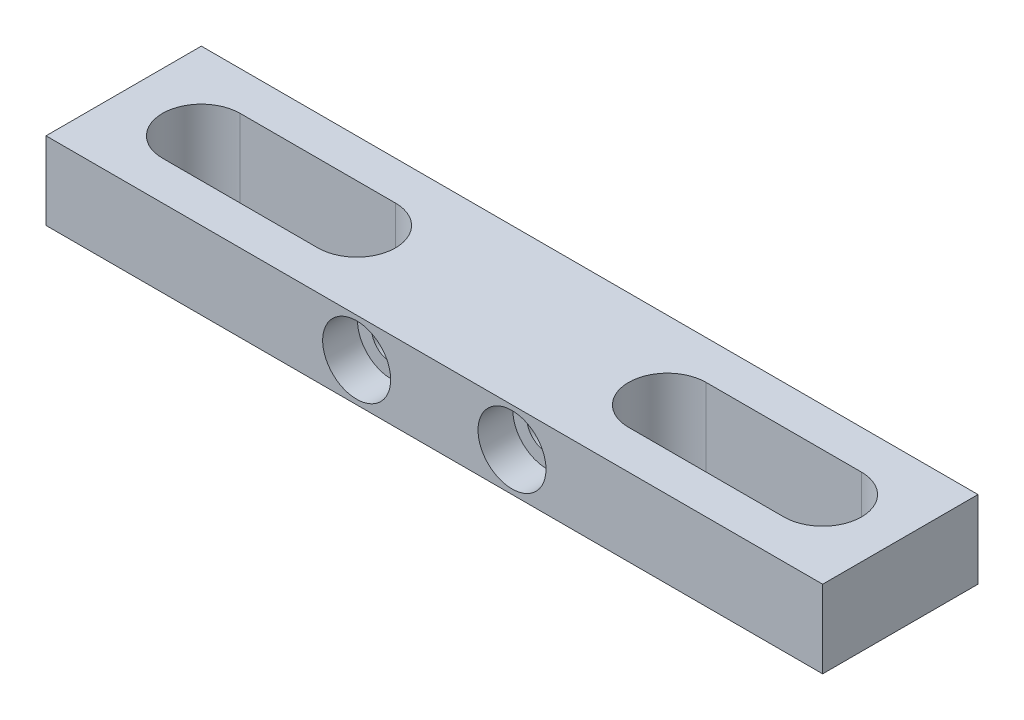
ISO-10303-21;
HEADER;
FILE_DESCRIPTION(('STEP AP214'),'2;1');
FILE_NAME('part.step','',(''),(''),'','','');
FILE_SCHEMA(('AUTOMOTIVE_DESIGN { 1 0 10303 214 1 1 1 1 }'));
ENDSEC;
DATA;
#1=APPLICATION_CONTEXT('core data for automotive mechanical design processes');
#2=APPLICATION_PROTOCOL_DEFINITION('international standard','automotive_design',2000,#1);
#3=PRODUCT_CONTEXT('',#1,'mechanical');
#4=PRODUCT('Part','Part','',(#3));
#5=PRODUCT_RELATED_PRODUCT_CATEGORY('part','',(#4));
#6=PRODUCT_DEFINITION_FORMATION('','',#4);
#7=PRODUCT_DEFINITION_CONTEXT('part definition',#1,'design');
#8=PRODUCT_DEFINITION('design','',#6,#7);
#9=PRODUCT_DEFINITION_SHAPE('','',#8);
#10=(LENGTH_UNIT() NAMED_UNIT(*) SI_UNIT(.MILLI.,.METRE.));
#11=(NAMED_UNIT(*) PLANE_ANGLE_UNIT() SI_UNIT($,.RADIAN.));
#12=(NAMED_UNIT(*) SI_UNIT($,.STERADIAN.) SOLID_ANGLE_UNIT());
#13=UNCERTAINTY_MEASURE_WITH_UNIT(LENGTH_MEASURE(1.E-05),#10,'distance_accuracy_value','');
#14=(GEOMETRIC_REPRESENTATION_CONTEXT(3) GLOBAL_UNCERTAINTY_ASSIGNED_CONTEXT((#13)) GLOBAL_UNIT_ASSIGNED_CONTEXT((#10,
#11,#12)) REPRESENTATION_CONTEXT('',''));
#15=CARTESIAN_POINT('',(0.,0.,0.));
#16=DIRECTION('',(0.,0.,1.));
#17=DIRECTION('',(1.,0.,0.));
#18=AXIS2_PLACEMENT_3D('',#15,#16,#17);
#19=CARTESIAN_POINT('',(-10.8557755775578,6.35,-8.84179867986799));
#20=DIRECTION('',(1.,0.,0.));
#21=DIRECTION('',(0.,0.,-1.));
#22=AXIS2_PLACEMENT_3D('',#19,#20,#21);
#23=PLANE('',#22);
#24=DIRECTION('',(0.,0.,1.));
#25=VECTOR('',#24,1.);
#26=CARTESIAN_POINT('',(-10.8557755775578,0.,-8.84179867986799));
#27=LINE('',#26,#25);
#28=CARTESIAN_POINT('',(-10.8557755775578,0.,-8.84179867986799));
#29=VERTEX_POINT('',#28);
#30=CARTESIAN_POINT('',(-10.8557755775578,0.,3.85820132013201));
#31=VERTEX_POINT('',#30);
#32=EDGE_CURVE('E267',#29,#31,#27,.T.);
#33=ORIENTED_EDGE('',*,*,#32,.T.);
#34=DIRECTION('',(0.,-1.,0.));
#35=VECTOR('',#34,1.);
#36=CARTESIAN_POINT('',(-10.8557755775578,6.35,3.85820132013201));
#37=LINE('',#36,#35);
#38=CARTESIAN_POINT('',(-10.8557755775578,6.35,3.85820132013201));
#39=VERTEX_POINT('',#38);
#40=EDGE_CURVE('E14',#39,#31,#37,.T.);
#41=ORIENTED_EDGE('',*,*,#40,.F.);
#42=DIRECTION('',(0.,0.,1.));
#43=VECTOR('',#42,1.);
#44=CARTESIAN_POINT('',(-10.8557755775578,6.35,-8.84179867986799));
#45=LINE('',#44,#43);
#46=CARTESIAN_POINT('',(-10.8557755775578,6.35,-8.84179867986799));
#47=VERTEX_POINT('',#46);
#48=EDGE_CURVE('E268',#47,#39,#45,.T.);
#49=ORIENTED_EDGE('',*,*,#48,.F.);
#50=DIRECTION('',(0.,-1.,0.));
#51=VECTOR('',#50,1.);
#52=CARTESIAN_POINT('',(-10.8557755775578,6.35,-8.84179867986799));
#53=LINE('',#52,#51);
#54=EDGE_CURVE('E278',#47,#29,#53,.T.);
#55=ORIENTED_EDGE('',*,*,#54,.T.);
#56=EDGE_LOOP('',(#33,#41,#49,#55));
#57=FACE_BOUND('',#56,.T.);
#58=ADVANCED_FACE('F87',(#57),#23,.F.);
#59=CARTESIAN_POINT('',(-10.8557755775578,6.35,3.85820132013201));
#60=DIRECTION('',(0.,0.,-1.));
#61=DIRECTION('',(-1.,0.,0.));
#62=AXIS2_PLACEMENT_3D('',#59,#60,#61);
#63=PLANE('',#62);
#64=CARTESIAN_POINT('',(14.5442244224422,3.175,3.85820132013201));
#65=DIRECTION('',(0.,0.,1.));
#66=DIRECTION('',(1.,0.,0.));
#67=AXIS2_PLACEMENT_3D('',#64,#65,#66);
#68=CIRCLE('',#67,2.77876);
#69=CARTESIAN_POINT('',(17.3229844224422,3.175,3.85820132013201));
#70=VERTEX_POINT('',#69);
#71=EDGE_CURVE('E237',#70,#70,#68,.T.);
#72=ORIENTED_EDGE('',*,*,#71,.F.);
#73=EDGE_LOOP('',(#72));
#74=FACE_BOUND('',#73,.T.);
#75=CARTESIAN_POINT('',(27.2442244224422,3.175,3.85820132013201));
#76=DIRECTION('',(0.,0.,1.));
#77=DIRECTION('',(1.,0.,0.));
#78=AXIS2_PLACEMENT_3D('',#75,#76,#77);
#79=CIRCLE('',#78,2.77876);
#80=CARTESIAN_POINT('',(30.0229844224422,3.175,3.85820132013201));
#81=VERTEX_POINT('',#80);
#82=EDGE_CURVE('E255',#81,#81,#79,.T.);
#83=ORIENTED_EDGE('',*,*,#82,.F.);
#84=EDGE_LOOP('',(#83));
#85=FACE_BOUND('',#84,.T.);
#86=DIRECTION('',(1.,0.,0.));
#87=VECTOR('',#86,1.);
#88=CARTESIAN_POINT('',(-10.8557755775578,0.,3.85820132013201));
#89=LINE('',#88,#87);
#90=CARTESIAN_POINT('',(52.6442244224422,0.,3.85820132013201));
#91=VERTEX_POINT('',#90);
#92=EDGE_CURVE('E281',#31,#91,#89,.T.);
#93=ORIENTED_EDGE('',*,*,#92,.T.);
#94=DIRECTION('',(0.,-1.,0.));
#95=VECTOR('',#94,1.);
#96=CARTESIAN_POINT('',(52.6442244224422,6.35,3.85820132013201));
#97=LINE('',#96,#95);
#98=CARTESIAN_POINT('',(52.6442244224422,6.35,3.85820132013201));
#99=VERTEX_POINT('',#98);
#100=EDGE_CURVE('E94',#99,#91,#97,.T.);
#101=ORIENTED_EDGE('',*,*,#100,.F.);
#102=DIRECTION('',(1.,0.,0.));
#103=VECTOR('',#102,1.);
#104=CARTESIAN_POINT('',(-10.8557755775578,6.35,3.85820132013201));
#105=LINE('',#104,#103);
#106=EDGE_CURVE('E271',#39,#99,#105,.T.);
#107=ORIENTED_EDGE('',*,*,#106,.F.);
#108=ORIENTED_EDGE('',*,*,#40,.T.);
#109=EDGE_LOOP('',(#93,#101,#107,#108));
#110=FACE_BOUND('',#109,.T.);
#111=ADVANCED_FACE('F310',(#74,#85,#110),#63,.F.);
#112=CARTESIAN_POINT('',(52.6442244224422,6.35,-8.84179867986799));
#113=DIRECTION('',(-1.,0.,0.));
#114=DIRECTION('',(0.,0.,1.));
#115=AXIS2_PLACEMENT_3D('',#112,#113,#114);
#116=PLANE('',#115);
#117=DIRECTION('',(0.,0.,-1.));
#118=VECTOR('',#117,1.);
#119=CARTESIAN_POINT('',(52.6442244224422,0.,-8.84179867986799));
#120=LINE('',#119,#118);
#121=CARTESIAN_POINT('',(52.6442244224422,0.,-8.84179867986799));
#122=VERTEX_POINT('',#121);
#123=EDGE_CURVE('E283',#91,#122,#120,.T.);
#124=ORIENTED_EDGE('',*,*,#123,.T.);
#125=DIRECTION('',(0.,-1.,0.));
#126=VECTOR('',#125,1.);
#127=CARTESIAN_POINT('',(52.6442244224422,6.35,-8.84179867986799));
#128=LINE('',#127,#126);
#129=CARTESIAN_POINT('',(52.6442244224422,6.35,-8.84179867986799));
#130=VERTEX_POINT('',#129);
#131=EDGE_CURVE('E288',#130,#122,#128,.T.);
#132=ORIENTED_EDGE('',*,*,#131,.F.);
#133=DIRECTION('',(0.,0.,-1.));
#134=VECTOR('',#133,1.);
#135=CARTESIAN_POINT('',(52.6442244224422,6.35,-8.84179867986799));
#136=LINE('',#135,#134);
#137=EDGE_CURVE('E274',#99,#130,#136,.T.);
#138=ORIENTED_EDGE('',*,*,#137,.F.);
#139=ORIENTED_EDGE('',*,*,#100,.T.);
#140=EDGE_LOOP('',(#124,#132,#138,#139));
#141=FACE_BOUND('',#140,.T.);
#142=ADVANCED_FACE('F295',(#141),#116,.F.);
#143=CARTESIAN_POINT('',(-10.8557755775578,6.35,-8.84179867986799));
#144=DIRECTION('',(0.,0.,1.));
#145=DIRECTION('',(1.,0.,0.));
#146=AXIS2_PLACEMENT_3D('',#143,#144,#145);
#147=PLANE('',#146);
#148=CARTESIAN_POINT('',(14.5442244224422,3.175,-8.84179867986799));
#149=DIRECTION('',(0.,0.,1.));
#150=DIRECTION('',(1.,0.,0.));
#151=AXIS2_PLACEMENT_3D('',#148,#149,#150);
#152=CIRCLE('',#151,1.63195);
#153=CARTESIAN_POINT('',(16.1761744224422,3.175,-8.84179867986799));
#154=VERTEX_POINT('',#153);
#155=EDGE_CURVE('E252',#154,#154,#152,.T.);
#156=ORIENTED_EDGE('',*,*,#155,.T.);
#157=EDGE_LOOP('',(#156));
#158=FACE_BOUND('',#157,.T.);
#159=CARTESIAN_POINT('',(27.2442244224422,3.175,-8.84179867986799));
#160=DIRECTION('',(0.,0.,1.));
#161=DIRECTION('',(1.,0.,0.));
#162=AXIS2_PLACEMENT_3D('',#159,#160,#161);
#163=CIRCLE('',#162,1.63195);
#164=CARTESIAN_POINT('',(28.8761744224422,3.175,-8.84179867986799));
#165=VERTEX_POINT('',#164);
#166=EDGE_CURVE('E264',#165,#165,#163,.T.);
#167=ORIENTED_EDGE('',*,*,#166,.T.);
#168=EDGE_LOOP('',(#167));
#169=FACE_BOUND('',#168,.T.);
#170=DIRECTION('',(-1.,0.,0.));
#171=VECTOR('',#170,1.);
#172=CARTESIAN_POINT('',(-10.8557755775578,0.,-8.84179867986799));
#173=LINE('',#172,#171);
#174=EDGE_CURVE('E272',#122,#29,#173,.T.);
#175=ORIENTED_EDGE('',*,*,#174,.T.);
#176=ORIENTED_EDGE('',*,*,#54,.F.);
#177=DIRECTION('',(-1.,0.,0.));
#178=VECTOR('',#177,1.);
#179=CARTESIAN_POINT('',(-10.8557755775578,6.35,-8.84179867986799));
#180=LINE('',#179,#178);
#181=EDGE_CURVE('E276',#130,#47,#180,.T.);
#182=ORIENTED_EDGE('',*,*,#181,.F.);
#183=ORIENTED_EDGE('',*,*,#131,.T.);
#184=EDGE_LOOP('',(#175,#176,#182,#183));
#185=FACE_BOUND('',#184,.T.);
#186=ADVANCED_FACE('F303',(#158,#169,#185),#147,.F.);
#187=CARTESIAN_POINT('',(0.,6.35,0.));
#188=DIRECTION('',(0.,1.,0.));
#189=DIRECTION('',(0.,0.,1.));
#190=AXIS2_PLACEMENT_3D('',#187,#188,#189);
#191=PLANE('',#190);
#192=CARTESIAN_POINT('',(33.5942244224423,6.35,-2.49179867986799));
#193=DIRECTION('',(0.,1.,0.));
#194=DIRECTION('',(0.,0.,1.));
#195=AXIS2_PLACEMENT_3D('',#192,#193,#194);
#196=CIRCLE('',#195,3.175);
#197=CARTESIAN_POINT('',(33.5942244224423,6.35,-5.66679867986799));
#198=VERTEX_POINT('',#197);
#199=CARTESIAN_POINT('',(33.5942244224423,6.35,0.683201320132012));
#200=VERTEX_POINT('',#199);
#201=EDGE_CURVE('E101',#198,#200,#196,.T.);
#202=ORIENTED_EDGE('',*,*,#201,.F.);
#203=DIRECTION('',(-1.,0.,0.));
#204=VECTOR('',#203,1.);
#205=CARTESIAN_POINT('',(33.5942244224423,6.35,-5.66679867986799));
#206=LINE('',#205,#204);
#207=CARTESIAN_POINT('',(46.2942244224422,6.35,-5.66679867986799));
#208=VERTEX_POINT('',#207);
#209=EDGE_CURVE('E193',#208,#198,#206,.T.);
#210=ORIENTED_EDGE('',*,*,#209,.F.);
#211=CARTESIAN_POINT('',(46.2942244224422,6.35,-2.49179867986799));
#212=DIRECTION('',(0.,1.,0.));
#213=DIRECTION('',(0.,0.,1.));
#214=AXIS2_PLACEMENT_3D('',#211,#212,#213);
#215=CIRCLE('',#214,3.175);
#216=CARTESIAN_POINT('',(46.2942244224422,6.35,0.683201320132012));
#217=VERTEX_POINT('',#216);
#218=EDGE_CURVE('E196',#217,#208,#215,.T.);
#219=ORIENTED_EDGE('',*,*,#218,.F.);
#220=DIRECTION('',(1.,0.,0.));
#221=VECTOR('',#220,1.);
#222=CARTESIAN_POINT('',(33.5942244224423,6.35,0.683201320132012));
#223=LINE('',#222,#221);
#224=EDGE_CURVE('E202',#200,#217,#223,.T.);
#225=ORIENTED_EDGE('',*,*,#224,.F.);
#226=EDGE_LOOP('',(#202,#210,#219,#225));
#227=FACE_BOUND('',#226,.T.);
#228=CARTESIAN_POINT('',(-4.50577557755775,6.35,-2.49179867986799));
#229=DIRECTION('',(0.,1.,0.));
#230=DIRECTION('',(0.,0.,1.));
#231=AXIS2_PLACEMENT_3D('',#228,#229,#230);
#232=CIRCLE('',#231,3.175);
#233=CARTESIAN_POINT('',(-4.50577557755775,6.35,-5.66679867986799));
#234=VERTEX_POINT('',#233);
#235=CARTESIAN_POINT('',(-4.50577557755775,6.35,0.683201320132011));
#236=VERTEX_POINT('',#235);
#237=EDGE_CURVE('E208',#234,#236,#232,.T.);
#238=ORIENTED_EDGE('',*,*,#237,.F.);
#239=DIRECTION('',(-1.,0.,0.));
#240=VECTOR('',#239,1.);
#241=CARTESIAN_POINT('',(-4.50577557755775,6.35,-5.66679867986799));
#242=LINE('',#241,#240);
#243=CARTESIAN_POINT('',(8.19422442244225,6.35,-5.66679867986799));
#244=VERTEX_POINT('',#243);
#245=EDGE_CURVE('E216',#244,#234,#242,.T.);
#246=ORIENTED_EDGE('',*,*,#245,.F.);
#247=CARTESIAN_POINT('',(8.19422442244225,6.35,-2.49179867986799));
#248=DIRECTION('',(0.,1.,0.));
#249=DIRECTION('',(0.,0.,1.));
#250=AXIS2_PLACEMENT_3D('',#247,#248,#249);
#251=CIRCLE('',#250,3.175);
#252=CARTESIAN_POINT('',(8.19422442244225,6.35,0.683201320132011));
#253=VERTEX_POINT('',#252);
#254=EDGE_CURVE('E230',#253,#244,#251,.T.);
#255=ORIENTED_EDGE('',*,*,#254,.F.);
#256=DIRECTION('',(1.,0.,0.));
#257=VECTOR('',#256,1.);
#258=CARTESIAN_POINT('',(-4.50577557755775,6.35,0.683201320132011));
#259=LINE('',#258,#257);
#260=EDGE_CURVE('E227',#236,#253,#259,.T.);
#261=ORIENTED_EDGE('',*,*,#260,.F.);
#262=EDGE_LOOP('',(#238,#246,#255,#261));
#263=FACE_BOUND('',#262,.T.);
#264=ORIENTED_EDGE('',*,*,#48,.T.);
#265=ORIENTED_EDGE('',*,*,#106,.T.);
#266=ORIENTED_EDGE('',*,*,#137,.T.);
#267=ORIENTED_EDGE('',*,*,#181,.T.);
#268=EDGE_LOOP('',(#264,#265,#266,#267));
#269=FACE_BOUND('',#268,.T.);
#270=ADVANCED_FACE('F309',(#227,#263,#269),#191,.T.);
#271=CARTESIAN_POINT('',(0.,0.,0.));
#272=DIRECTION('',(0.,1.,0.));
#273=DIRECTION('',(0.,0.,1.));
#274=AXIS2_PLACEMENT_3D('',#271,#272,#273);
#275=PLANE('',#274);
#276=DIRECTION('',(-1.,0.,0.));
#277=VECTOR('',#276,1.);
#278=CARTESIAN_POINT('',(33.5942244224423,0.,-5.66679867986799));
#279=LINE('',#278,#277);
#280=CARTESIAN_POINT('',(46.2942244224422,0.,-5.66679867986799));
#281=VERTEX_POINT('',#280);
#282=CARTESIAN_POINT('',(33.5942244224423,0.,-5.66679867986799));
#283=VERTEX_POINT('',#282);
#284=EDGE_CURVE('E183',#281,#283,#279,.T.);
#285=ORIENTED_EDGE('',*,*,#284,.T.);
#286=CARTESIAN_POINT('',(33.5942244224423,0.,-2.49179867986799));
#287=DIRECTION('',(0.,1.,0.));
#288=DIRECTION('',(0.,0.,1.));
#289=AXIS2_PLACEMENT_3D('',#286,#287,#288);
#290=CIRCLE('',#289,3.175);
#291=CARTESIAN_POINT('',(33.5942244224423,0.,0.683201320132012));
#292=VERTEX_POINT('',#291);
#293=EDGE_CURVE('E177',#283,#292,#290,.T.);
#294=ORIENTED_EDGE('',*,*,#293,.T.);
#295=DIRECTION('',(1.,0.,0.));
#296=VECTOR('',#295,1.);
#297=CARTESIAN_POINT('',(33.5942244224423,0.,0.683201320132012));
#298=LINE('',#297,#296);
#299=CARTESIAN_POINT('',(46.2942244224422,0.,0.683201320132012));
#300=VERTEX_POINT('',#299);
#301=EDGE_CURVE('E186',#292,#300,#298,.T.);
#302=ORIENTED_EDGE('',*,*,#301,.T.);
#303=CARTESIAN_POINT('',(46.2942244224422,0.,-2.49179867986799));
#304=DIRECTION('',(0.,1.,0.));
#305=DIRECTION('',(0.,0.,1.));
#306=AXIS2_PLACEMENT_3D('',#303,#304,#305);
#307=CIRCLE('',#306,3.175);
#308=EDGE_CURVE('E109',#300,#281,#307,.T.);
#309=ORIENTED_EDGE('',*,*,#308,.T.);
#310=EDGE_LOOP('',(#285,#294,#302,#309));
#311=FACE_BOUND('',#310,.T.);
#312=DIRECTION('',(-1.,0.,0.));
#313=VECTOR('',#312,1.);
#314=CARTESIAN_POINT('',(-4.50577557755775,0.,-5.66679867986799));
#315=LINE('',#314,#313);
#316=CARTESIAN_POINT('',(8.19422442244225,0.,-5.66679867986799));
#317=VERTEX_POINT('',#316);
#318=CARTESIAN_POINT('',(-4.50577557755775,0.,-5.66679867986799));
#319=VERTEX_POINT('',#318);
#320=EDGE_CURVE('E222',#317,#319,#315,.T.);
#321=ORIENTED_EDGE('',*,*,#320,.T.);
#322=CARTESIAN_POINT('',(-4.50577557755775,0.,-2.49179867986799));
#323=DIRECTION('',(0.,1.,0.));
#324=DIRECTION('',(0.,0.,1.));
#325=AXIS2_PLACEMENT_3D('',#322,#323,#324);
#326=CIRCLE('',#325,3.175);
#327=CARTESIAN_POINT('',(-4.50577557755775,0.,0.683201320132011));
#328=VERTEX_POINT('',#327);
#329=EDGE_CURVE('E212',#319,#328,#326,.T.);
#330=ORIENTED_EDGE('',*,*,#329,.T.);
#331=DIRECTION('',(1.,0.,0.));
#332=VECTOR('',#331,1.);
#333=CARTESIAN_POINT('',(-4.50577557755775,0.,0.683201320132011));
#334=LINE('',#333,#332);
#335=CARTESIAN_POINT('',(8.19422442244225,0.,0.683201320132011));
#336=VERTEX_POINT('',#335);
#337=EDGE_CURVE('E215',#328,#336,#334,.T.);
#338=ORIENTED_EDGE('',*,*,#337,.T.);
#339=CARTESIAN_POINT('',(8.19422442244225,0.,-2.49179867986799));
#340=DIRECTION('',(0.,1.,0.));
#341=DIRECTION('',(0.,0.,1.));
#342=AXIS2_PLACEMENT_3D('',#339,#340,#341);
#343=CIRCLE('',#342,3.175);
#344=EDGE_CURVE('E219',#336,#317,#343,.T.);
#345=ORIENTED_EDGE('',*,*,#344,.T.);
#346=EDGE_LOOP('',(#321,#330,#338,#345));
#347=FACE_BOUND('',#346,.T.);
#348=ORIENTED_EDGE('',*,*,#32,.F.);
#349=ORIENTED_EDGE('',*,*,#174,.F.);
#350=ORIENTED_EDGE('',*,*,#123,.F.);
#351=ORIENTED_EDGE('',*,*,#92,.F.);
#352=EDGE_LOOP('',(#348,#349,#350,#351));
#353=FACE_BOUND('',#352,.T.);
#354=ADVANCED_FACE('F190',(#311,#347,#353),#275,.F.);
#355=CARTESIAN_POINT('',(27.2442244224422,3.175,3.85820132013201));
#356=DIRECTION('',(0.,0.,1.));
#357=DIRECTION('',(1.,0.,0.));
#358=AXIS2_PLACEMENT_3D('',#355,#356,#357);
#359=CYLINDRICAL_SURFACE('',#358,1.63195);
#360=ORIENTED_EDGE('',*,*,#166,.F.);
#361=EDGE_LOOP('',(#360));
#362=FACE_BOUND('',#361,.T.);
#363=CARTESIAN_POINT('',(27.2442244224422,3.175,1.01340132013201));
#364=DIRECTION('',(0.,0.,1.));
#365=DIRECTION('',(1.,0.,0.));
#366=AXIS2_PLACEMENT_3D('',#363,#364,#365);
#367=CIRCLE('',#366,1.63195);
#368=CARTESIAN_POINT('',(28.8761744224422,3.175,1.01340132013201));
#369=VERTEX_POINT('',#368);
#370=EDGE_CURVE('E261',#369,#369,#367,.T.);
#371=ORIENTED_EDGE('',*,*,#370,.T.);
#372=EDGE_LOOP('',(#371));
#373=FACE_BOUND('',#372,.T.);
#374=ADVANCED_FACE('F326',(#362,#373),#359,.F.);
#375=CARTESIAN_POINT('',(28.8761744224422,3.175,1.01340132013201));
#376=DIRECTION('',(0.,0.,-1.));
#377=DIRECTION('',(-1.,0.,0.));
#378=AXIS2_PLACEMENT_3D('',#375,#376,#377);
#379=PLANE('',#378);
#380=ORIENTED_EDGE('',*,*,#370,.F.);
#381=EDGE_LOOP('',(#380));
#382=FACE_BOUND('',#381,.T.);
#383=CARTESIAN_POINT('',(27.2442244224422,3.175,1.01340132013201));
#384=DIRECTION('',(0.,0.,1.));
#385=DIRECTION('',(1.,0.,0.));
#386=AXIS2_PLACEMENT_3D('',#383,#384,#385);
#387=CIRCLE('',#386,2.77876);
#388=CARTESIAN_POINT('',(30.0229844224422,3.175,1.01340132013201));
#389=VERTEX_POINT('',#388);
#390=EDGE_CURVE('E258',#389,#389,#387,.T.);
#391=ORIENTED_EDGE('',*,*,#390,.T.);
#392=EDGE_LOOP('',(#391));
#393=FACE_BOUND('',#392,.T.);
#394=ADVANCED_FACE('F332',(#382,#393),#379,.F.);
#395=CARTESIAN_POINT('',(27.2442244224422,3.175,3.85820132013201));
#396=DIRECTION('',(0.,0.,1.));
#397=DIRECTION('',(1.,0.,0.));
#398=AXIS2_PLACEMENT_3D('',#395,#396,#397);
#399=CYLINDRICAL_SURFACE('',#398,2.77876);
#400=ORIENTED_EDGE('',*,*,#390,.F.);
#401=EDGE_LOOP('',(#400));
#402=FACE_BOUND('',#401,.T.);
#403=ORIENTED_EDGE('',*,*,#82,.T.);
#404=EDGE_LOOP('',(#403));
#405=FACE_BOUND('',#404,.T.);
#406=ADVANCED_FACE('F336',(#402,#405),#399,.F.);
#407=CARTESIAN_POINT('',(14.5442244224422,3.175,3.85820132013201));
#408=DIRECTION('',(0.,0.,1.));
#409=DIRECTION('',(1.,0.,0.));
#410=AXIS2_PLACEMENT_3D('',#407,#408,#409);
#411=CYLINDRICAL_SURFACE('',#410,1.63195);
#412=ORIENTED_EDGE('',*,*,#155,.F.);
#413=EDGE_LOOP('',(#412));
#414=FACE_BOUND('',#413,.T.);
#415=CARTESIAN_POINT('',(14.5442244224422,3.175,1.01340132013201));
#416=DIRECTION('',(0.,0.,1.));
#417=DIRECTION('',(1.,0.,0.));
#418=AXIS2_PLACEMENT_3D('',#415,#416,#417);
#419=CIRCLE('',#418,1.63195);
#420=CARTESIAN_POINT('',(16.1761744224422,3.175,1.01340132013201));
#421=VERTEX_POINT('',#420);
#422=EDGE_CURVE('E249',#421,#421,#419,.T.);
#423=ORIENTED_EDGE('',*,*,#422,.T.);
#424=EDGE_LOOP('',(#423));
#425=FACE_BOUND('',#424,.T.);
#426=ADVANCED_FACE('F340',(#414,#425),#411,.F.);
#427=CARTESIAN_POINT('',(16.1761744224422,3.175,1.01340132013201));
#428=DIRECTION('',(0.,0.,-1.));
#429=DIRECTION('',(-1.,0.,0.));
#430=AXIS2_PLACEMENT_3D('',#427,#428,#429);
#431=PLANE('',#430);
#432=ORIENTED_EDGE('',*,*,#422,.F.);
#433=EDGE_LOOP('',(#432));
#434=FACE_BOUND('',#433,.T.);
#435=CARTESIAN_POINT('',(14.5442244224422,3.175,1.01340132013201));
#436=DIRECTION('',(0.,0.,1.));
#437=DIRECTION('',(1.,0.,0.));
#438=AXIS2_PLACEMENT_3D('',#435,#436,#437);
#439=CIRCLE('',#438,2.77876);
#440=CARTESIAN_POINT('',(17.3229844224422,3.175,1.01340132013201));
#441=VERTEX_POINT('',#440);
#442=EDGE_CURVE('E246',#441,#441,#439,.T.);
#443=ORIENTED_EDGE('',*,*,#442,.T.);
#444=EDGE_LOOP('',(#443));
#445=FACE_BOUND('',#444,.T.);
#446=ADVANCED_FACE('F344',(#434,#445),#431,.F.);
#447=CARTESIAN_POINT('',(14.5442244224422,3.175,3.85820132013201));
#448=DIRECTION('',(0.,0.,1.));
#449=DIRECTION('',(1.,0.,0.));
#450=AXIS2_PLACEMENT_3D('',#447,#448,#449);
#451=CYLINDRICAL_SURFACE('',#450,2.77876);
#452=ORIENTED_EDGE('',*,*,#442,.F.);
#453=EDGE_LOOP('',(#452));
#454=FACE_BOUND('',#453,.T.);
#455=ORIENTED_EDGE('',*,*,#71,.T.);
#456=EDGE_LOOP('',(#455));
#457=FACE_BOUND('',#456,.T.);
#458=ADVANCED_FACE('F348',(#454,#457),#451,.F.);
#459=CARTESIAN_POINT('',(-4.50577557755775,0.,-2.49179867986799));
#460=DIRECTION('',(0.,1.,0.));
#461=DIRECTION('',(0.,0.,1.));
#462=AXIS2_PLACEMENT_3D('',#459,#460,#461);
#463=CYLINDRICAL_SURFACE('',#462,3.175);
#464=ORIENTED_EDGE('',*,*,#237,.T.);
#465=DIRECTION('',(0.,1.,0.));
#466=VECTOR('',#465,1.);
#467=CARTESIAN_POINT('',(-4.50577557755775,0.,0.683201320132011));
#468=LINE('',#467,#466);
#469=EDGE_CURVE('E225',#328,#236,#468,.T.);
#470=ORIENTED_EDGE('',*,*,#469,.F.);
#471=ORIENTED_EDGE('',*,*,#329,.F.);
#472=DIRECTION('',(0.,1.,0.));
#473=VECTOR('',#472,1.);
#474=CARTESIAN_POINT('',(-4.50577557755775,0.,-5.66679867986799));
#475=LINE('',#474,#473);
#476=EDGE_CURVE('E235',#319,#234,#475,.T.);
#477=ORIENTED_EDGE('',*,*,#476,.T.);
#478=EDGE_LOOP('',(#464,#470,#471,#477));
#479=FACE_BOUND('',#478,.T.);
#480=ADVANCED_FACE('F352',(#479),#463,.F.);
#481=CARTESIAN_POINT('',(-4.50577557755775,0.,-5.66679867986799));
#482=DIRECTION('',(0.,0.,-1.));
#483=DIRECTION('',(-1.,0.,0.));
#484=AXIS2_PLACEMENT_3D('',#481,#482,#483);
#485=PLANE('',#484);
#486=ORIENTED_EDGE('',*,*,#245,.T.);
#487=ORIENTED_EDGE('',*,*,#476,.F.);
#488=ORIENTED_EDGE('',*,*,#320,.F.);
#489=DIRECTION('',(0.,1.,0.));
#490=VECTOR('',#489,1.);
#491=CARTESIAN_POINT('',(8.19422442244225,0.,-5.66679867986799));
#492=LINE('',#491,#490);
#493=EDGE_CURVE('E238',#317,#244,#492,.T.);
#494=ORIENTED_EDGE('',*,*,#493,.T.);
#495=EDGE_LOOP('',(#486,#487,#488,#494));
#496=FACE_BOUND('',#495,.T.);
#497=ADVANCED_FACE('F356',(#496),#485,.F.);
#498=CARTESIAN_POINT('',(8.19422442244225,0.,-2.49179867986799));
#499=DIRECTION('',(0.,1.,0.));
#500=DIRECTION('',(0.,0.,1.));
#501=AXIS2_PLACEMENT_3D('',#498,#499,#500);
#502=CYLINDRICAL_SURFACE('',#501,3.175);
#503=ORIENTED_EDGE('',*,*,#254,.T.);
#504=ORIENTED_EDGE('',*,*,#493,.F.);
#505=ORIENTED_EDGE('',*,*,#344,.F.);
#506=DIRECTION('',(0.,1.,0.));
#507=VECTOR('',#506,1.);
#508=CARTESIAN_POINT('',(8.19422442244225,0.,0.683201320132011));
#509=LINE('',#508,#507);
#510=EDGE_CURVE('E240',#336,#253,#509,.T.);
#511=ORIENTED_EDGE('',*,*,#510,.T.);
#512=EDGE_LOOP('',(#503,#504,#505,#511));
#513=FACE_BOUND('',#512,.T.);
#514=ADVANCED_FACE('F361',(#513),#502,.F.);
#515=CARTESIAN_POINT('',(-4.50577557755775,0.,0.683201320132011));
#516=DIRECTION('',(0.,0.,1.));
#517=DIRECTION('',(1.,0.,0.));
#518=AXIS2_PLACEMENT_3D('',#515,#516,#517);
#519=PLANE('',#518);
#520=ORIENTED_EDGE('',*,*,#260,.T.);
#521=ORIENTED_EDGE('',*,*,#510,.F.);
#522=ORIENTED_EDGE('',*,*,#337,.F.);
#523=ORIENTED_EDGE('',*,*,#469,.T.);
#524=EDGE_LOOP('',(#520,#521,#522,#523));
#525=FACE_BOUND('',#524,.T.);
#526=ADVANCED_FACE('F358',(#525),#519,.F.);
#527=CARTESIAN_POINT('',(33.5942244224423,0.,-2.49179867986799));
#528=DIRECTION('',(0.,1.,0.));
#529=DIRECTION('',(0.,0.,1.));
#530=AXIS2_PLACEMENT_3D('',#527,#528,#529);
#531=CYLINDRICAL_SURFACE('',#530,3.175);
#532=ORIENTED_EDGE('',*,*,#201,.T.);
#533=DIRECTION('',(0.,1.,0.));
#534=VECTOR('',#533,1.);
#535=CARTESIAN_POINT('',(33.5942244224423,0.,0.683201320132012));
#536=LINE('',#535,#534);
#537=EDGE_CURVE('E173',#292,#200,#536,.T.);
#538=ORIENTED_EDGE('',*,*,#537,.F.);
#539=ORIENTED_EDGE('',*,*,#293,.F.);
#540=DIRECTION('',(0.,1.,0.));
#541=VECTOR('',#540,1.);
#542=CARTESIAN_POINT('',(33.5942244224423,0.,-5.66679867986799));
#543=LINE('',#542,#541);
#544=EDGE_CURVE('E206',#283,#198,#543,.T.);
#545=ORIENTED_EDGE('',*,*,#544,.T.);
#546=EDGE_LOOP('',(#532,#538,#539,#545));
#547=FACE_BOUND('',#546,.T.);
#548=ADVANCED_FACE('F175',(#547),#531,.F.);
#549=CARTESIAN_POINT('',(33.5942244224423,0.,-5.66679867986799));
#550=DIRECTION('',(0.,0.,-1.));
#551=DIRECTION('',(-1.,0.,0.));
#552=AXIS2_PLACEMENT_3D('',#549,#550,#551);
#553=PLANE('',#552);
#554=ORIENTED_EDGE('',*,*,#209,.T.);
#555=ORIENTED_EDGE('',*,*,#544,.F.);
#556=ORIENTED_EDGE('',*,*,#284,.F.);
#557=DIRECTION('',(0.,1.,0.));
#558=VECTOR('',#557,1.);
#559=CARTESIAN_POINT('',(46.2942244224422,0.,-5.66679867986799));
#560=LINE('',#559,#558);
#561=EDGE_CURVE('E209',#281,#208,#560,.T.);
#562=ORIENTED_EDGE('',*,*,#561,.T.);
#563=EDGE_LOOP('',(#554,#555,#556,#562));
#564=FACE_BOUND('',#563,.T.);
#565=ADVANCED_FACE('F371',(#564),#553,.F.);
#566=CARTESIAN_POINT('',(46.2942244224422,0.,-2.49179867986799));
#567=DIRECTION('',(0.,1.,0.));
#568=DIRECTION('',(0.,0.,1.));
#569=AXIS2_PLACEMENT_3D('',#566,#567,#568);
#570=CYLINDRICAL_SURFACE('',#569,3.175);
#571=ORIENTED_EDGE('',*,*,#218,.T.);
#572=ORIENTED_EDGE('',*,*,#561,.F.);
#573=ORIENTED_EDGE('',*,*,#308,.F.);
#574=DIRECTION('',(0.,1.,0.));
#575=VECTOR('',#574,1.);
#576=CARTESIAN_POINT('',(46.2942244224422,0.,0.683201320132012));
#577=LINE('',#576,#575);
#578=EDGE_CURVE('E182',#300,#217,#577,.T.);
#579=ORIENTED_EDGE('',*,*,#578,.T.);
#580=EDGE_LOOP('',(#571,#572,#573,#579));
#581=FACE_BOUND('',#580,.T.);
#582=ADVANCED_FACE('F374',(#581),#570,.F.);
#583=CARTESIAN_POINT('',(33.5942244224423,0.,0.683201320132012));
#584=DIRECTION('',(0.,0.,1.));
#585=DIRECTION('',(1.,0.,0.));
#586=AXIS2_PLACEMENT_3D('',#583,#584,#585);
#587=PLANE('',#586);
#588=ORIENTED_EDGE('',*,*,#224,.T.);
#589=ORIENTED_EDGE('',*,*,#578,.F.);
#590=ORIENTED_EDGE('',*,*,#301,.F.);
#591=ORIENTED_EDGE('',*,*,#537,.T.);
#592=EDGE_LOOP('',(#588,#589,#590,#591));
#593=FACE_BOUND('',#592,.T.);
#594=ADVANCED_FACE('F187',(#593),#587,.F.);
#595=CLOSED_SHELL('',(#58,#111,#142,#186,#270,#354,#374,#394,#406,#426,#446,#458,#480,#497,#514,
#526,#548,#565,#582,#594));
#596=MANIFOLD_SOLID_BREP('B2',#595);
#597=ADVANCED_BREP_SHAPE_REPRESENTATION('',(#18,#596),#14);
#598=SHAPE_DEFINITION_REPRESENTATION(#9,#597);
ENDSEC;
END-ISO-10303-21;
